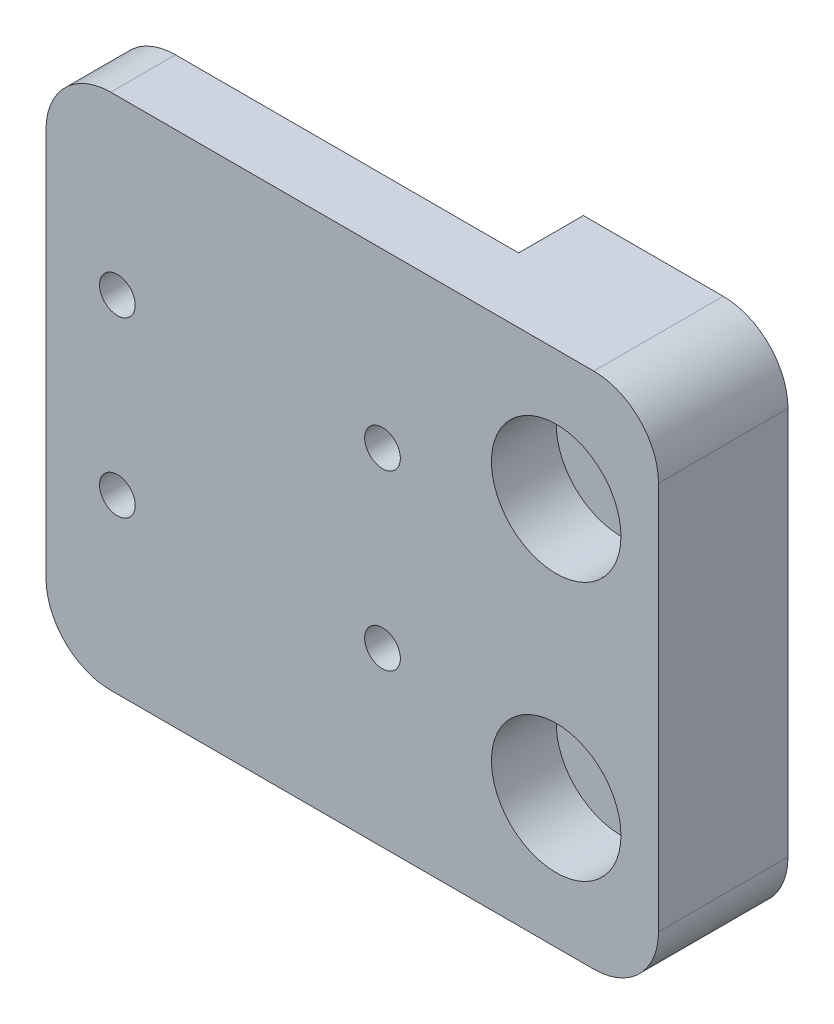
ISO-10303-21;
HEADER;
FILE_DESCRIPTION(('STEP AP214'),'2;1');
FILE_NAME('part.step','',(''),(''),'','','');
FILE_SCHEMA(('AUTOMOTIVE_DESIGN { 1 0 10303 214 1 1 1 1 }'));
ENDSEC;
DATA;
#1=APPLICATION_CONTEXT('core data for automotive mechanical design processes');
#2=APPLICATION_PROTOCOL_DEFINITION('international standard','automotive_design',2000,#1);
#3=PRODUCT_CONTEXT('',#1,'mechanical');
#4=PRODUCT('Part','Part','',(#3));
#5=PRODUCT_RELATED_PRODUCT_CATEGORY('part','',(#4));
#6=PRODUCT_DEFINITION_FORMATION('','',#4);
#7=PRODUCT_DEFINITION_CONTEXT('part definition',#1,'design');
#8=PRODUCT_DEFINITION('design','',#6,#7);
#9=PRODUCT_DEFINITION_SHAPE('','',#8);
#10=(LENGTH_UNIT() NAMED_UNIT(*) SI_UNIT(.MILLI.,.METRE.));
#11=(NAMED_UNIT(*) PLANE_ANGLE_UNIT() SI_UNIT($,.RADIAN.));
#12=(NAMED_UNIT(*) SI_UNIT($,.STERADIAN.) SOLID_ANGLE_UNIT());
#13=UNCERTAINTY_MEASURE_WITH_UNIT(LENGTH_MEASURE(1.E-05),#10,'distance_accuracy_value','');
#14=(GEOMETRIC_REPRESENTATION_CONTEXT(3) GLOBAL_UNCERTAINTY_ASSIGNED_CONTEXT((#13)) GLOBAL_UNIT_ASSIGNED_CONTEXT((#10,
#11,#12)) REPRESENTATION_CONTEXT('',''));
#15=CARTESIAN_POINT('',(0.,0.,0.));
#16=DIRECTION('',(0.,0.,1.));
#17=DIRECTION('',(1.,0.,0.));
#18=AXIS2_PLACEMENT_3D('',#15,#16,#17);
#19=CARTESIAN_POINT('',(0.,-12.7,0.));
#20=DIRECTION('',(0.,0.,1.));
#21=DIRECTION('',(1.,0.,0.));
#22=AXIS2_PLACEMENT_3D('',#19,#20,#21);
#23=CYLINDRICAL_SURFACE('',#22,2.286);
#24=CARTESIAN_POINT('',(0.,-12.7,0.));
#25=DIRECTION('',(0.,0.,1.));
#26=DIRECTION('',(1.,0.,0.));
#27=AXIS2_PLACEMENT_3D('',#24,#25,#26);
#28=CIRCLE('',#27,2.286);
#29=CARTESIAN_POINT('',(2.286,-12.7,0.));
#30=VERTEX_POINT('',#29);
#31=EDGE_CURVE('E113',#30,#30,#28,.T.);
#32=ORIENTED_EDGE('',*,*,#31,.F.);
#33=EDGE_LOOP('',(#32));
#34=FACE_BOUND('',#33,.T.);
#35=CARTESIAN_POINT('',(0.,-12.7,6.35));
#36=DIRECTION('',(0.,0.,1.));
#37=DIRECTION('',(1.,0.,0.));
#38=AXIS2_PLACEMENT_3D('',#35,#36,#37);
#39=CIRCLE('',#38,2.286);
#40=CARTESIAN_POINT('',(2.286,-12.7,6.35));
#41=VERTEX_POINT('',#40);
#42=EDGE_CURVE('E145',#41,#41,#39,.F.);
#43=ORIENTED_EDGE('',*,*,#42,.F.);
#44=EDGE_LOOP('',(#43));
#45=FACE_BOUND('',#44,.T.);
#46=ADVANCED_FACE('F32',(#34,#45),#23,.F.);
#47=CARTESIAN_POINT('',(0.,12.7,0.));
#48=DIRECTION('',(0.,0.,1.));
#49=DIRECTION('',(1.,0.,0.));
#50=AXIS2_PLACEMENT_3D('',#47,#48,#49);
#51=CYLINDRICAL_SURFACE('',#50,2.286);
#52=CARTESIAN_POINT('',(0.,12.7,0.));
#53=DIRECTION('',(0.,0.,1.));
#54=DIRECTION('',(1.,0.,0.));
#55=AXIS2_PLACEMENT_3D('',#52,#53,#54);
#56=CIRCLE('',#55,2.286);
#57=CARTESIAN_POINT('',(2.286,12.7,0.));
#58=VERTEX_POINT('',#57);
#59=EDGE_CURVE('E199',#58,#58,#56,.T.);
#60=ORIENTED_EDGE('',*,*,#59,.F.);
#61=EDGE_LOOP('',(#60));
#62=FACE_BOUND('',#61,.T.);
#63=CARTESIAN_POINT('',(0.,12.7,6.35));
#64=DIRECTION('',(0.,0.,1.));
#65=DIRECTION('',(1.,0.,0.));
#66=AXIS2_PLACEMENT_3D('',#63,#64,#65);
#67=CIRCLE('',#66,2.286);
#68=CARTESIAN_POINT('',(2.286,12.7,6.35));
#69=VERTEX_POINT('',#68);
#70=EDGE_CURVE('E142',#69,#69,#67,.F.);
#71=ORIENTED_EDGE('',*,*,#70,.F.);
#72=EDGE_LOOP('',(#71));
#73=FACE_BOUND('',#72,.T.);
#74=ADVANCED_FACE('F291',(#62,#73),#51,.F.);
#75=CARTESIAN_POINT('',(10.033,-25.4,12.7));
#76=DIRECTION('',(-1.,0.,0.));
#77=DIRECTION('',(0.,0.,1.));
#78=AXIS2_PLACEMENT_3D('',#75,#76,#77);
#79=PLANE('',#78);
#80=DIRECTION('',(0.,1.,0.));
#81=VECTOR('',#80,1.);
#82=CARTESIAN_POINT('',(10.033,-25.4,0.));
#83=LINE('',#82,#81);
#84=CARTESIAN_POINT('',(10.033,-19.05,0.));
#85=VERTEX_POINT('',#84);
#86=CARTESIAN_POINT('',(10.033,19.05,0.));
#87=VERTEX_POINT('',#86);
#88=EDGE_CURVE('E192',#85,#87,#83,.T.);
#89=ORIENTED_EDGE('',*,*,#88,.T.);
#90=DIRECTION('',(0.,0.,-1.));
#91=VECTOR('',#90,1.);
#92=CARTESIAN_POINT('',(10.033,19.05,12.7));
#93=LINE('',#92,#91);
#94=CARTESIAN_POINT('',(10.033,19.05,12.7));
#95=VERTEX_POINT('',#94);
#96=EDGE_CURVE('E162',#87,#95,#93,.F.);
#97=ORIENTED_EDGE('',*,*,#96,.T.);
#98=DIRECTION('',(0.,1.,0.));
#99=VECTOR('',#98,1.);
#100=CARTESIAN_POINT('',(10.033,-25.4,12.7));
#101=LINE('',#100,#99);
#102=CARTESIAN_POINT('',(10.033,-19.05,12.7));
#103=VERTEX_POINT('',#102);
#104=EDGE_CURVE('E194',#103,#95,#101,.T.);
#105=ORIENTED_EDGE('',*,*,#104,.F.);
#106=DIRECTION('',(0.,0.,-1.));
#107=VECTOR('',#106,1.);
#108=CARTESIAN_POINT('',(10.033,-19.05,12.7));
#109=LINE('',#108,#107);
#110=EDGE_CURVE('E159',#103,#85,#109,.T.);
#111=ORIENTED_EDGE('',*,*,#110,.T.);
#112=EDGE_LOOP('',(#89,#97,#105,#111));
#113=FACE_BOUND('',#112,.T.);
#114=ADVANCED_FACE('F191',(#113),#79,.F.);
#115=CARTESIAN_POINT('',(-10.033,25.4,12.7));
#116=DIRECTION('',(0.,-1.,0.));
#117=DIRECTION('',(0.,0.,-1.));
#118=AXIS2_PLACEMENT_3D('',#115,#116,#117);
#119=PLANE('',#118);
#120=DIRECTION('',(-1.,0.,0.));
#121=VECTOR('',#120,1.);
#122=CARTESIAN_POINT('',(-10.033,25.4,12.7));
#123=LINE('',#122,#121);
#124=CARTESIAN_POINT('',(3.683,25.4,12.7));
#125=VERTEX_POINT('',#124);
#126=CARTESIAN_POINT('',(-43.683,25.4,12.7));
#127=VERTEX_POINT('',#126);
#128=EDGE_CURVE('E136',#125,#127,#123,.T.);
#129=ORIENTED_EDGE('',*,*,#128,.F.);
#130=DIRECTION('',(0.,0.,-1.));
#131=VECTOR('',#130,1.);
#132=CARTESIAN_POINT('',(3.683,25.4,12.7));
#133=LINE('',#132,#131);
#134=CARTESIAN_POINT('',(3.683,25.4,0.));
#135=VERTEX_POINT('',#134);
#136=EDGE_CURVE('E152',#125,#135,#133,.T.);
#137=ORIENTED_EDGE('',*,*,#136,.T.);
#138=DIRECTION('',(-1.,0.,0.));
#139=VECTOR('',#138,1.);
#140=CARTESIAN_POINT('',(-10.033,25.4,0.));
#141=LINE('',#140,#139);
#142=CARTESIAN_POINT('',(-10.033,25.4,0.));
#143=VERTEX_POINT('',#142);
#144=EDGE_CURVE('E198',#135,#143,#141,.T.);
#145=ORIENTED_EDGE('',*,*,#144,.T.);
#146=DIRECTION('',(0.,0.,-1.));
#147=VECTOR('',#146,1.);
#148=CARTESIAN_POINT('',(-10.033,25.4,12.7));
#149=LINE('',#148,#147);
#150=CARTESIAN_POINT('',(-10.033,25.4,6.35));
#151=VERTEX_POINT('',#150);
#152=EDGE_CURVE('E130',#151,#143,#149,.T.);
#153=ORIENTED_EDGE('',*,*,#152,.F.);
#154=DIRECTION('',(-1.,0.,0.));
#155=VECTOR('',#154,1.);
#156=CARTESIAN_POINT('',(-10.033,25.4,6.35));
#157=LINE('',#156,#155);
#158=CARTESIAN_POINT('',(-43.683,25.4,6.35));
#159=VERTEX_POINT('',#158);
#160=EDGE_CURVE('E120',#151,#159,#157,.T.);
#161=ORIENTED_EDGE('',*,*,#160,.T.);
#162=DIRECTION('',(0.,0.,1.));
#163=VECTOR('',#162,1.);
#164=CARTESIAN_POINT('',(-43.683,25.4,12.7));
#165=LINE('',#164,#163);
#166=EDGE_CURVE('E133',#159,#127,#165,.T.);
#167=ORIENTED_EDGE('',*,*,#166,.T.);
#168=EDGE_LOOP('',(#129,#137,#145,#153,#161,#167));
#169=FACE_BOUND('',#168,.T.);
#170=ADVANCED_FACE('F309',(#169),#119,.F.);
#171=CARTESIAN_POINT('',(-10.033,-25.4,12.7));
#172=DIRECTION('',(1.,0.,0.));
#173=DIRECTION('',(0.,0.,-1.));
#174=AXIS2_PLACEMENT_3D('',#171,#172,#173);
#175=PLANE('',#174);
#176=DIRECTION('',(0.,0.,-1.));
#177=VECTOR('',#176,1.);
#178=CARTESIAN_POINT('',(-10.033,-25.4,12.7));
#179=LINE('',#178,#177);
#180=CARTESIAN_POINT('',(-10.033,-25.4,6.35));
#181=VERTEX_POINT('',#180);
#182=CARTESIAN_POINT('',(-10.033,-25.4,0.));
#183=VERTEX_POINT('',#182);
#184=EDGE_CURVE('E111',#181,#183,#179,.T.);
#185=ORIENTED_EDGE('',*,*,#184,.F.);
#186=DIRECTION('',(0.,1.,0.));
#187=VECTOR('',#186,1.);
#188=CARTESIAN_POINT('',(-10.033,25.4,6.35));
#189=LINE('',#188,#187);
#190=EDGE_CURVE('E117',#181,#151,#189,.T.);
#191=ORIENTED_EDGE('',*,*,#190,.T.);
#192=ORIENTED_EDGE('',*,*,#152,.T.);
#193=DIRECTION('',(0.,-1.,0.));
#194=VECTOR('',#193,1.);
#195=CARTESIAN_POINT('',(-10.033,-25.4,0.));
#196=LINE('',#195,#194);
#197=EDGE_CURVE('E128',#143,#183,#196,.T.);
#198=ORIENTED_EDGE('',*,*,#197,.T.);
#199=EDGE_LOOP('',(#185,#191,#192,#198));
#200=FACE_BOUND('',#199,.T.);
#201=ADVANCED_FACE('F126',(#200),#175,.F.);
#202=CARTESIAN_POINT('',(-10.033,-25.4,12.7));
#203=DIRECTION('',(0.,1.,0.));
#204=DIRECTION('',(0.,0.,1.));
#205=AXIS2_PLACEMENT_3D('',#202,#203,#204);
#206=PLANE('',#205);
#207=DIRECTION('',(1.,0.,0.));
#208=VECTOR('',#207,1.);
#209=CARTESIAN_POINT('',(-10.033,-25.4,12.7));
#210=LINE('',#209,#208);
#211=CARTESIAN_POINT('',(-43.683,-25.4,12.7));
#212=VERTEX_POINT('',#211);
#213=CARTESIAN_POINT('',(3.683,-25.4,12.7));
#214=VERTEX_POINT('',#213);
#215=EDGE_CURVE('E131',#212,#214,#210,.T.);
#216=ORIENTED_EDGE('',*,*,#215,.F.);
#217=DIRECTION('',(0.,0.,1.));
#218=VECTOR('',#217,1.);
#219=CARTESIAN_POINT('',(-43.683,-25.4,6.35));
#220=LINE('',#219,#218);
#221=CARTESIAN_POINT('',(-43.683,-25.4,6.35));
#222=VERTEX_POINT('',#221);
#223=EDGE_CURVE('E11',#212,#222,#220,.F.);
#224=ORIENTED_EDGE('',*,*,#223,.T.);
#225=DIRECTION('',(1.,0.,0.));
#226=VECTOR('',#225,1.);
#227=CARTESIAN_POINT('',(-10.033,-25.4,6.35));
#228=LINE('',#227,#226);
#229=EDGE_CURVE('E106',#222,#181,#228,.T.);
#230=ORIENTED_EDGE('',*,*,#229,.T.);
#231=ORIENTED_EDGE('',*,*,#184,.T.);
#232=DIRECTION('',(1.,0.,0.));
#233=VECTOR('',#232,1.);
#234=CARTESIAN_POINT('',(-10.033,-25.4,0.));
#235=LINE('',#234,#233);
#236=CARTESIAN_POINT('',(3.683,-25.4,0.));
#237=VERTEX_POINT('',#236);
#238=EDGE_CURVE('E139',#183,#237,#235,.T.);
#239=ORIENTED_EDGE('',*,*,#238,.T.);
#240=DIRECTION('',(0.,0.,-1.));
#241=VECTOR('',#240,1.);
#242=CARTESIAN_POINT('',(3.683,-25.4,12.7));
#243=LINE('',#242,#241);
#244=EDGE_CURVE('E40',#237,#214,#243,.F.);
#245=ORIENTED_EDGE('',*,*,#244,.T.);
#246=EDGE_LOOP('',(#216,#224,#230,#231,#239,#245));
#247=FACE_BOUND('',#246,.T.);
#248=ADVANCED_FACE('F108',(#247),#206,.F.);
#249=CARTESIAN_POINT('',(0.,0.,12.7));
#250=DIRECTION('',(0.,0.,-1.));
#251=DIRECTION('',(-1.,0.,0.));
#252=AXIS2_PLACEMENT_3D('',#249,#250,#251);
#253=PLANE('',#252);
#254=CARTESIAN_POINT('',(0.,12.7,12.7));
#255=DIRECTION('',(0.,0.,1.));
#256=DIRECTION('',(1.,0.,0.));
#257=AXIS2_PLACEMENT_3D('',#254,#255,#256);
#258=CIRCLE('',#257,6.35);
#259=CARTESIAN_POINT('',(6.35,12.7,12.7));
#260=VERTEX_POINT('',#259);
#261=EDGE_CURVE('E243',#260,#260,#258,.T.);
#262=ORIENTED_EDGE('',*,*,#261,.F.);
#263=EDGE_LOOP('',(#262));
#264=FACE_BOUND('',#263,.T.);
#265=CARTESIAN_POINT('',(0.,-12.7,12.7));
#266=DIRECTION('',(0.,0.,1.));
#267=DIRECTION('',(1.,0.,0.));
#268=AXIS2_PLACEMENT_3D('',#265,#266,#267);
#269=CIRCLE('',#268,6.35);
#270=CARTESIAN_POINT('',(6.35,-12.7,12.7));
#271=VERTEX_POINT('',#270);
#272=EDGE_CURVE('E237',#271,#271,#269,.T.);
#273=ORIENTED_EDGE('',*,*,#272,.F.);
#274=EDGE_LOOP('',(#273));
#275=FACE_BOUND('',#274,.T.);
#276=CARTESIAN_POINT('',(-17.033,8.5,12.7));
#277=DIRECTION('',(0.,0.,-1.));
#278=DIRECTION('',(-1.,0.,0.));
#279=AXIS2_PLACEMENT_3D('',#276,#277,#278);
#280=CIRCLE('',#279,1.75);
#281=CARTESIAN_POINT('',(-18.783,8.5,12.7));
#282=VERTEX_POINT('',#281);
#283=EDGE_CURVE('E218',#282,#282,#280,.T.);
#284=ORIENTED_EDGE('',*,*,#283,.T.);
#285=EDGE_LOOP('',(#284));
#286=FACE_BOUND('',#285,.T.);
#287=CARTESIAN_POINT('',(-43.033,-8.5,12.7));
#288=DIRECTION('',(0.,0.,-1.));
#289=DIRECTION('',(-1.,0.,0.));
#290=AXIS2_PLACEMENT_3D('',#287,#288,#289);
#291=CIRCLE('',#290,1.75);
#292=CARTESIAN_POINT('',(-44.783,-8.5,12.7));
#293=VERTEX_POINT('',#292);
#294=EDGE_CURVE('E224',#293,#293,#291,.T.);
#295=ORIENTED_EDGE('',*,*,#294,.T.);
#296=EDGE_LOOP('',(#295));
#297=FACE_BOUND('',#296,.T.);
#298=CARTESIAN_POINT('',(-17.033,-8.5,12.7));
#299=DIRECTION('',(0.,0.,-1.));
#300=DIRECTION('',(-1.,0.,0.));
#301=AXIS2_PLACEMENT_3D('',#298,#299,#300);
#302=CIRCLE('',#301,1.75);
#303=CARTESIAN_POINT('',(-18.783,-8.5,12.7));
#304=VERTEX_POINT('',#303);
#305=EDGE_CURVE('E225',#304,#304,#302,.T.);
#306=ORIENTED_EDGE('',*,*,#305,.T.);
#307=EDGE_LOOP('',(#306));
#308=FACE_BOUND('',#307,.T.);
#309=CARTESIAN_POINT('',(-43.033,8.5,12.7));
#310=DIRECTION('',(0.,0.,-1.));
#311=DIRECTION('',(-1.,0.,0.));
#312=AXIS2_PLACEMENT_3D('',#309,#310,#311);
#313=CIRCLE('',#312,1.75);
#314=CARTESIAN_POINT('',(-44.783,8.5,12.7));
#315=VERTEX_POINT('',#314);
#316=EDGE_CURVE('E211',#315,#315,#313,.T.);
#317=ORIENTED_EDGE('',*,*,#316,.T.);
#318=EDGE_LOOP('',(#317));
#319=FACE_BOUND('',#318,.T.);
#320=ORIENTED_EDGE('',*,*,#104,.T.);
#321=CARTESIAN_POINT('',(3.683,19.05,12.7));
#322=DIRECTION('',(0.,0.,-1.));
#323=DIRECTION('',(-1.,0.,0.));
#324=AXIS2_PLACEMENT_3D('',#321,#322,#323);
#325=CIRCLE('',#324,6.35);
#326=EDGE_CURVE('E170',#95,#125,#325,.F.);
#327=ORIENTED_EDGE('',*,*,#326,.T.);
#328=ORIENTED_EDGE('',*,*,#128,.T.);
#329=CARTESIAN_POINT('',(-43.683,19.05,12.7));
#330=DIRECTION('',(0.,0.,-1.));
#331=DIRECTION('',(-1.,0.,0.));
#332=AXIS2_PLACEMENT_3D('',#329,#330,#331);
#333=CIRCLE('',#332,6.35);
#334=CARTESIAN_POINT('',(-50.033,19.05,12.7));
#335=VERTEX_POINT('',#334);
#336=EDGE_CURVE('E168',#127,#335,#333,.F.);
#337=ORIENTED_EDGE('',*,*,#336,.T.);
#338=DIRECTION('',(0.,-1.,0.));
#339=VECTOR('',#338,1.);
#340=CARTESIAN_POINT('',(-50.033,25.4,12.7));
#341=LINE('',#340,#339);
#342=CARTESIAN_POINT('',(-50.033,-19.05,12.7));
#343=VERTEX_POINT('',#342);
#344=EDGE_CURVE('E124',#335,#343,#341,.T.);
#345=ORIENTED_EDGE('',*,*,#344,.T.);
#346=CARTESIAN_POINT('',(-43.683,-19.05,12.7));
#347=DIRECTION('',(0.,0.,-1.));
#348=DIRECTION('',(-1.,0.,0.));
#349=AXIS2_PLACEMENT_3D('',#346,#347,#348);
#350=CIRCLE('',#349,6.35);
#351=EDGE_CURVE('E166',#343,#212,#350,.F.);
#352=ORIENTED_EDGE('',*,*,#351,.T.);
#353=ORIENTED_EDGE('',*,*,#215,.T.);
#354=CARTESIAN_POINT('',(3.683,-19.05,12.7));
#355=DIRECTION('',(0.,0.,-1.));
#356=DIRECTION('',(-1.,0.,0.));
#357=AXIS2_PLACEMENT_3D('',#354,#355,#356);
#358=CIRCLE('',#357,6.35);
#359=EDGE_CURVE('E164',#214,#103,#358,.F.);
#360=ORIENTED_EDGE('',*,*,#359,.T.);
#361=EDGE_LOOP('',(#320,#327,#328,#337,#345,#352,#353,#360));
#362=FACE_BOUND('',#361,.T.);
#363=ADVANCED_FACE('F184',(#264,#275,#286,#297,#308,#319,#362),#253,.F.);
#364=CARTESIAN_POINT('',(0.,0.,0.));
#365=DIRECTION('',(0.,0.,-1.));
#366=DIRECTION('',(-1.,0.,0.));
#367=AXIS2_PLACEMENT_3D('',#364,#365,#366);
#368=PLANE('',#367);
#369=ORIENTED_EDGE('',*,*,#59,.T.);
#370=EDGE_LOOP('',(#369));
#371=FACE_BOUND('',#370,.T.);
#372=ORIENTED_EDGE('',*,*,#31,.T.);
#373=EDGE_LOOP('',(#372));
#374=FACE_BOUND('',#373,.T.);
#375=ORIENTED_EDGE('',*,*,#144,.F.);
#376=CARTESIAN_POINT('',(3.683,19.05,0.));
#377=DIRECTION('',(0.,0.,-1.));
#378=DIRECTION('',(-1.,0.,0.));
#379=AXIS2_PLACEMENT_3D('',#376,#377,#378);
#380=CIRCLE('',#379,6.35);
#381=EDGE_CURVE('E157',#135,#87,#380,.T.);
#382=ORIENTED_EDGE('',*,*,#381,.T.);
#383=ORIENTED_EDGE('',*,*,#88,.F.);
#384=CARTESIAN_POINT('',(3.683,-19.05,0.));
#385=DIRECTION('',(0.,0.,-1.));
#386=DIRECTION('',(-1.,0.,0.));
#387=AXIS2_PLACEMENT_3D('',#384,#385,#386);
#388=CIRCLE('',#387,6.35);
#389=EDGE_CURVE('E155',#85,#237,#388,.T.);
#390=ORIENTED_EDGE('',*,*,#389,.T.);
#391=ORIENTED_EDGE('',*,*,#238,.F.);
#392=ORIENTED_EDGE('',*,*,#197,.F.);
#393=EDGE_LOOP('',(#375,#382,#383,#390,#391,#392));
#394=FACE_BOUND('',#393,.T.);
#395=ADVANCED_FACE('F197',(#371,#374,#394),#368,.T.);
#396=CARTESIAN_POINT('',(-50.033,25.4,6.35));
#397=DIRECTION('',(-1.,0.,0.));
#398=DIRECTION('',(0.,-1.,0.));
#399=AXIS2_PLACEMENT_3D('',#396,#397,#398);
#400=PLANE('',#399);
#401=ORIENTED_EDGE('',*,*,#344,.F.);
#402=DIRECTION('',(0.,0.,1.));
#403=VECTOR('',#402,1.);
#404=CARTESIAN_POINT('',(-50.033,19.05,6.35));
#405=LINE('',#404,#403);
#406=CARTESIAN_POINT('',(-50.033,19.05,6.35));
#407=VERTEX_POINT('',#406);
#408=EDGE_CURVE('E175',#335,#407,#405,.F.);
#409=ORIENTED_EDGE('',*,*,#408,.T.);
#410=DIRECTION('',(0.,-1.,0.));
#411=VECTOR('',#410,1.);
#412=CARTESIAN_POINT('',(-50.033,25.4,6.35));
#413=LINE('',#412,#411);
#414=CARTESIAN_POINT('',(-50.033,-19.05,6.35));
#415=VERTEX_POINT('',#414);
#416=EDGE_CURVE('E114',#407,#415,#413,.T.);
#417=ORIENTED_EDGE('',*,*,#416,.T.);
#418=DIRECTION('',(0.,0.,1.));
#419=VECTOR('',#418,1.);
#420=CARTESIAN_POINT('',(-50.033,-19.05,12.7));
#421=LINE('',#420,#419);
#422=EDGE_CURVE('E172',#415,#343,#421,.T.);
#423=ORIENTED_EDGE('',*,*,#422,.T.);
#424=EDGE_LOOP('',(#401,#409,#417,#423));
#425=FACE_BOUND('',#424,.T.);
#426=ADVANCED_FACE('F280',(#425),#400,.T.);
#427=CARTESIAN_POINT('',(0.,0.,6.35));
#428=DIRECTION('',(0.,0.,-1.));
#429=DIRECTION('',(-1.,0.,0.));
#430=AXIS2_PLACEMENT_3D('',#427,#428,#429);
#431=PLANE('',#430);
#432=CARTESIAN_POINT('',(-17.033,8.5,6.35));
#433=DIRECTION('',(0.,0.,-1.));
#434=DIRECTION('',(-1.,0.,0.));
#435=AXIS2_PLACEMENT_3D('',#432,#433,#434);
#436=CIRCLE('',#435,1.75);
#437=CARTESIAN_POINT('',(-18.783,8.5,6.35));
#438=VERTEX_POINT('',#437);
#439=EDGE_CURVE('E228',#438,#438,#436,.T.);
#440=ORIENTED_EDGE('',*,*,#439,.F.);
#441=EDGE_LOOP('',(#440));
#442=FACE_BOUND('',#441,.T.);
#443=CARTESIAN_POINT('',(-43.033,-8.5,6.35));
#444=DIRECTION('',(0.,0.,-1.));
#445=DIRECTION('',(-1.,0.,0.));
#446=AXIS2_PLACEMENT_3D('',#443,#444,#445);
#447=CIRCLE('',#446,1.75);
#448=CARTESIAN_POINT('',(-44.783,-8.5,6.35));
#449=VERTEX_POINT('',#448);
#450=EDGE_CURVE('E221',#449,#449,#447,.T.);
#451=ORIENTED_EDGE('',*,*,#450,.F.);
#452=EDGE_LOOP('',(#451));
#453=FACE_BOUND('',#452,.T.);
#454=CARTESIAN_POINT('',(-17.033,-8.5,6.35));
#455=DIRECTION('',(0.,0.,-1.));
#456=DIRECTION('',(-1.,0.,0.));
#457=AXIS2_PLACEMENT_3D('',#454,#455,#456);
#458=CIRCLE('',#457,1.75);
#459=CARTESIAN_POINT('',(-18.783,-8.5,6.35));
#460=VERTEX_POINT('',#459);
#461=EDGE_CURVE('E149',#460,#460,#458,.T.);
#462=ORIENTED_EDGE('',*,*,#461,.F.);
#463=EDGE_LOOP('',(#462));
#464=FACE_BOUND('',#463,.T.);
#465=CARTESIAN_POINT('',(-43.033,8.5,6.35));
#466=DIRECTION('',(0.,0.,-1.));
#467=DIRECTION('',(-1.,0.,0.));
#468=AXIS2_PLACEMENT_3D('',#465,#466,#467);
#469=CIRCLE('',#468,1.75);
#470=CARTESIAN_POINT('',(-44.783,8.5,6.35));
#471=VERTEX_POINT('',#470);
#472=EDGE_CURVE('E215',#471,#471,#469,.T.);
#473=ORIENTED_EDGE('',*,*,#472,.F.);
#474=EDGE_LOOP('',(#473));
#475=FACE_BOUND('',#474,.T.);
#476=ORIENTED_EDGE('',*,*,#416,.F.);
#477=CARTESIAN_POINT('',(-43.683,19.05,6.35));
#478=DIRECTION('',(0.,0.,-1.));
#479=DIRECTION('',(-1.,0.,0.));
#480=AXIS2_PLACEMENT_3D('',#477,#478,#479);
#481=CIRCLE('',#480,6.35);
#482=EDGE_CURVE('E178',#407,#159,#481,.T.);
#483=ORIENTED_EDGE('',*,*,#482,.T.);
#484=ORIENTED_EDGE('',*,*,#160,.F.);
#485=ORIENTED_EDGE('',*,*,#190,.F.);
#486=ORIENTED_EDGE('',*,*,#229,.F.);
#487=CARTESIAN_POINT('',(-43.683,-19.05,6.35));
#488=DIRECTION('',(0.,0.,-1.));
#489=DIRECTION('',(-1.,0.,0.));
#490=AXIS2_PLACEMENT_3D('',#487,#488,#489);
#491=CIRCLE('',#490,6.35);
#492=EDGE_CURVE('E52',#222,#415,#491,.T.);
#493=ORIENTED_EDGE('',*,*,#492,.T.);
#494=EDGE_LOOP('',(#476,#483,#484,#485,#486,#493));
#495=FACE_BOUND('',#494,.T.);
#496=ADVANCED_FACE('F118',(#442,#453,#464,#475,#495),#431,.T.);
#497=CARTESIAN_POINT('',(-43.033,8.5,12.7));
#498=DIRECTION('',(0.,0.,-1.));
#499=DIRECTION('',(-1.,0.,0.));
#500=AXIS2_PLACEMENT_3D('',#497,#498,#499);
#501=CYLINDRICAL_SURFACE('',#500,1.75);
#502=ORIENTED_EDGE('',*,*,#316,.F.);
#503=EDGE_LOOP('',(#502));
#504=FACE_BOUND('',#503,.T.);
#505=ORIENTED_EDGE('',*,*,#472,.T.);
#506=EDGE_LOOP('',(#505));
#507=FACE_BOUND('',#506,.T.);
#508=ADVANCED_FACE('F272',(#504,#507),#501,.F.);
#509=CARTESIAN_POINT('',(-17.033,-8.5,12.7));
#510=DIRECTION('',(0.,0.,-1.));
#511=DIRECTION('',(-1.,0.,0.));
#512=AXIS2_PLACEMENT_3D('',#509,#510,#511);
#513=CYLINDRICAL_SURFACE('',#512,1.75);
#514=ORIENTED_EDGE('',*,*,#305,.F.);
#515=EDGE_LOOP('',(#514));
#516=FACE_BOUND('',#515,.T.);
#517=ORIENTED_EDGE('',*,*,#461,.T.);
#518=EDGE_LOOP('',(#517));
#519=FACE_BOUND('',#518,.T.);
#520=ADVANCED_FACE('F275',(#516,#519),#513,.F.);
#521=CARTESIAN_POINT('',(-43.033,-8.5,12.7));
#522=DIRECTION('',(0.,0.,-1.));
#523=DIRECTION('',(-1.,0.,0.));
#524=AXIS2_PLACEMENT_3D('',#521,#522,#523);
#525=CYLINDRICAL_SURFACE('',#524,1.75);
#526=ORIENTED_EDGE('',*,*,#294,.F.);
#527=EDGE_LOOP('',(#526));
#528=FACE_BOUND('',#527,.T.);
#529=ORIENTED_EDGE('',*,*,#450,.T.);
#530=EDGE_LOOP('',(#529));
#531=FACE_BOUND('',#530,.T.);
#532=ADVANCED_FACE('F450',(#528,#531),#525,.F.);
#533=CARTESIAN_POINT('',(-17.033,8.5,12.7));
#534=DIRECTION('',(0.,0.,-1.));
#535=DIRECTION('',(-1.,0.,0.));
#536=AXIS2_PLACEMENT_3D('',#533,#534,#535);
#537=CYLINDRICAL_SURFACE('',#536,1.75);
#538=ORIENTED_EDGE('',*,*,#283,.F.);
#539=EDGE_LOOP('',(#538));
#540=FACE_BOUND('',#539,.T.);
#541=ORIENTED_EDGE('',*,*,#439,.T.);
#542=EDGE_LOOP('',(#541));
#543=FACE_BOUND('',#542,.T.);
#544=ADVANCED_FACE('F431',(#540,#543),#537,.F.);
#545=CARTESIAN_POINT('',(0.,12.7,6.35));
#546=DIRECTION('',(0.,0.,1.));
#547=DIRECTION('',(1.,0.,0.));
#548=AXIS2_PLACEMENT_3D('',#545,#546,#547);
#549=PLANE('',#548);
#550=CARTESIAN_POINT('',(0.,12.7,6.35));
#551=DIRECTION('',(0.,0.,1.));
#552=DIRECTION('',(1.,0.,0.));
#553=AXIS2_PLACEMENT_3D('',#550,#551,#552);
#554=CIRCLE('',#553,6.35);
#555=CARTESIAN_POINT('',(6.35,12.7,6.35));
#556=VERTEX_POINT('',#555);
#557=EDGE_CURVE('E146',#556,#556,#554,.T.);
#558=ORIENTED_EDGE('',*,*,#557,.T.);
#559=EDGE_LOOP('',(#558));
#560=FACE_BOUND('',#559,.T.);
#561=ORIENTED_EDGE('',*,*,#70,.T.);
#562=EDGE_LOOP('',(#561));
#563=FACE_BOUND('',#562,.T.);
#564=ADVANCED_FACE('F249',(#560,#563),#549,.T.);
#565=CARTESIAN_POINT('',(0.,12.7,6.35));
#566=DIRECTION('',(0.,0.,1.));
#567=DIRECTION('',(1.,0.,0.));
#568=AXIS2_PLACEMENT_3D('',#565,#566,#567);
#569=CYLINDRICAL_SURFACE('',#568,6.35);
#570=ORIENTED_EDGE('',*,*,#557,.F.);
#571=EDGE_LOOP('',(#570));
#572=FACE_BOUND('',#571,.T.);
#573=ORIENTED_EDGE('',*,*,#261,.T.);
#574=EDGE_LOOP('',(#573));
#575=FACE_BOUND('',#574,.T.);
#576=ADVANCED_FACE('F252',(#572,#575),#569,.F.);
#577=CARTESIAN_POINT('',(0.,-12.7,6.35));
#578=DIRECTION('',(0.,0.,1.));
#579=DIRECTION('',(1.,0.,0.));
#580=AXIS2_PLACEMENT_3D('',#577,#578,#579);
#581=PLANE('',#580);
#582=CARTESIAN_POINT('',(0.,-12.7,6.35));
#583=DIRECTION('',(0.,0.,1.));
#584=DIRECTION('',(1.,0.,0.));
#585=AXIS2_PLACEMENT_3D('',#582,#583,#584);
#586=CIRCLE('',#585,6.35);
#587=CARTESIAN_POINT('',(6.35,-12.7,6.35));
#588=VERTEX_POINT('',#587);
#589=EDGE_CURVE('E240',#588,#588,#586,.T.);
#590=ORIENTED_EDGE('',*,*,#589,.T.);
#591=EDGE_LOOP('',(#590));
#592=FACE_BOUND('',#591,.T.);
#593=ORIENTED_EDGE('',*,*,#42,.T.);
#594=EDGE_LOOP('',(#593));
#595=FACE_BOUND('',#594,.T.);
#596=ADVANCED_FACE('F255',(#592,#595),#581,.T.);
#597=CARTESIAN_POINT('',(0.,-12.7,6.35));
#598=DIRECTION('',(0.,0.,1.));
#599=DIRECTION('',(1.,0.,0.));
#600=AXIS2_PLACEMENT_3D('',#597,#598,#599);
#601=CYLINDRICAL_SURFACE('',#600,6.35);
#602=ORIENTED_EDGE('',*,*,#589,.F.);
#603=EDGE_LOOP('',(#602));
#604=FACE_BOUND('',#603,.T.);
#605=ORIENTED_EDGE('',*,*,#272,.T.);
#606=EDGE_LOOP('',(#605));
#607=FACE_BOUND('',#606,.T.);
#608=ADVANCED_FACE('F319',(#604,#607),#601,.F.);
#609=CARTESIAN_POINT('',(3.683,19.05,12.7));
#610=DIRECTION('',(0.,0.,-1.));
#611=DIRECTION('',(-1.,0.,0.));
#612=AXIS2_PLACEMENT_3D('',#609,#610,#611);
#613=CYLINDRICAL_SURFACE('',#612,6.35);
#614=ORIENTED_EDGE('',*,*,#326,.F.);
#615=ORIENTED_EDGE('',*,*,#96,.F.);
#616=ORIENTED_EDGE('',*,*,#381,.F.);
#617=ORIENTED_EDGE('',*,*,#136,.F.);
#618=EDGE_LOOP('',(#614,#615,#616,#617));
#619=FACE_BOUND('',#618,.T.);
#620=ADVANCED_FACE('F315',(#619),#613,.T.);
#621=CARTESIAN_POINT('',(-43.683,19.05,12.7));
#622=DIRECTION('',(0.,0.,-1.));
#623=DIRECTION('',(-1.,0.,0.));
#624=AXIS2_PLACEMENT_3D('',#621,#622,#623);
#625=CYLINDRICAL_SURFACE('',#624,6.35);
#626=ORIENTED_EDGE('',*,*,#482,.F.);
#627=ORIENTED_EDGE('',*,*,#408,.F.);
#628=ORIENTED_EDGE('',*,*,#336,.F.);
#629=ORIENTED_EDGE('',*,*,#166,.F.);
#630=EDGE_LOOP('',(#626,#627,#628,#629));
#631=FACE_BOUND('',#630,.T.);
#632=ADVANCED_FACE('F318',(#631),#625,.T.);
#633=CARTESIAN_POINT('',(-43.683,-19.05,6.35));
#634=DIRECTION('',(0.,0.,-1.));
#635=DIRECTION('',(-1.,0.,0.));
#636=AXIS2_PLACEMENT_3D('',#633,#634,#635);
#637=CYLINDRICAL_SURFACE('',#636,6.35);
#638=ORIENTED_EDGE('',*,*,#492,.F.);
#639=ORIENTED_EDGE('',*,*,#223,.F.);
#640=ORIENTED_EDGE('',*,*,#351,.F.);
#641=ORIENTED_EDGE('',*,*,#422,.F.);
#642=EDGE_LOOP('',(#638,#639,#640,#641));
#643=FACE_BOUND('',#642,.T.);
#644=ADVANCED_FACE('F322',(#643),#637,.T.);
#645=CARTESIAN_POINT('',(3.683,-19.05,12.7));
#646=DIRECTION('',(0.,0.,-1.));
#647=DIRECTION('',(-1.,0.,0.));
#648=AXIS2_PLACEMENT_3D('',#645,#646,#647);
#649=CYLINDRICAL_SURFACE('',#648,6.35);
#650=ORIENTED_EDGE('',*,*,#359,.F.);
#651=ORIENTED_EDGE('',*,*,#244,.F.);
#652=ORIENTED_EDGE('',*,*,#389,.F.);
#653=ORIENTED_EDGE('',*,*,#110,.F.);
#654=EDGE_LOOP('',(#650,#651,#652,#653));
#655=FACE_BOUND('',#654,.T.);
#656=ADVANCED_FACE('F34',(#655),#649,.T.);
#657=CLOSED_SHELL('',(#46,#74,#114,#170,#201,#248,#363,#395,#426,#496,#508,#520,#532,#544,#564,
#576,#596,#608,#620,#632,#644,#656));
#658=MANIFOLD_SOLID_BREP('B2',#657);
#659=ADVANCED_BREP_SHAPE_REPRESENTATION('',(#18,#658),#14);
#660=SHAPE_DEFINITION_REPRESENTATION(#9,#659);
ENDSEC;
END-ISO-10303-21;
